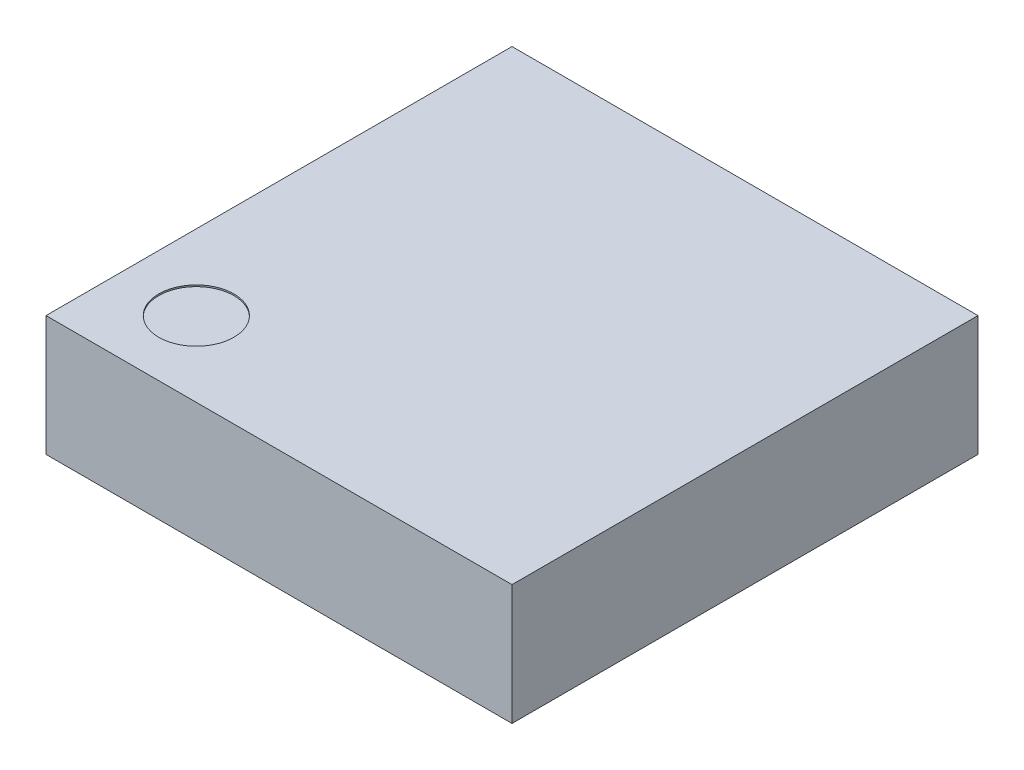
ISO-10303-21;
HEADER;
FILE_DESCRIPTION(('STEP AP214'),'2;1');
FILE_NAME('part.step','',(''),(''),'','','');
FILE_SCHEMA(('AUTOMOTIVE_DESIGN { 1 0 10303 214 1 1 1 1 }'));
ENDSEC;
DATA;
#1=APPLICATION_CONTEXT('core data for automotive mechanical design processes');
#2=APPLICATION_PROTOCOL_DEFINITION('international standard','automotive_design',2000,#1);
#3=PRODUCT_CONTEXT('',#1,'mechanical');
#4=PRODUCT('Part','Part','',(#3));
#5=PRODUCT_RELATED_PRODUCT_CATEGORY('part','',(#4));
#6=PRODUCT_DEFINITION_FORMATION('','',#4);
#7=PRODUCT_DEFINITION_CONTEXT('part definition',#1,'design');
#8=PRODUCT_DEFINITION('design','',#6,#7);
#9=PRODUCT_DEFINITION_SHAPE('','',#8);
#10=(LENGTH_UNIT() NAMED_UNIT(*) SI_UNIT(.MILLI.,.METRE.));
#11=(NAMED_UNIT(*) PLANE_ANGLE_UNIT() SI_UNIT($,.RADIAN.));
#12=(NAMED_UNIT(*) SI_UNIT($,.STERADIAN.) SOLID_ANGLE_UNIT());
#13=UNCERTAINTY_MEASURE_WITH_UNIT(LENGTH_MEASURE(1.E-05),#10,'distance_accuracy_value','');
#14=(GEOMETRIC_REPRESENTATION_CONTEXT(3) GLOBAL_UNCERTAINTY_ASSIGNED_CONTEXT((#13)) GLOBAL_UNIT_ASSIGNED_CONTEXT((#10,
#11,#12)) REPRESENTATION_CONTEXT('',''));
#15=CARTESIAN_POINT('',(0.,0.,0.));
#16=DIRECTION('',(0.,0.,1.));
#17=DIRECTION('',(1.,0.,0.));
#18=AXIS2_PLACEMENT_3D('',#15,#16,#17);
#19=CARTESIAN_POINT('',(1.55,0.8,1.55));
#20=DIRECTION('',(-1.,0.,0.));
#21=DIRECTION('',(0.,0.,1.));
#22=AXIS2_PLACEMENT_3D('',#19,#20,#21);
#23=PLANE('',#22);
#24=DIRECTION('',(0.,0.,-1.));
#25=VECTOR('',#24,1.);
#26=CARTESIAN_POINT('',(1.55,0.,1.55));
#27=LINE('',#26,#25);
#28=CARTESIAN_POINT('',(1.55,0.,1.55));
#29=VERTEX_POINT('',#28);
#30=CARTESIAN_POINT('',(1.55,0.,-1.55));
#31=VERTEX_POINT('',#30);
#32=EDGE_CURVE('E99',#29,#31,#27,.T.);
#33=ORIENTED_EDGE('',*,*,#32,.T.);
#34=DIRECTION('',(0.,-1.,0.));
#35=VECTOR('',#34,1.);
#36=CARTESIAN_POINT('',(1.55,0.8,-1.55));
#37=LINE('',#36,#35);
#38=CARTESIAN_POINT('',(1.55,0.8,-1.55));
#39=VERTEX_POINT('',#38);
#40=EDGE_CURVE('E11',#39,#31,#37,.T.);
#41=ORIENTED_EDGE('',*,*,#40,.F.);
#42=DIRECTION('',(0.,0.,-1.));
#43=VECTOR('',#42,1.);
#44=CARTESIAN_POINT('',(1.55,0.8,1.55));
#45=LINE('',#44,#43);
#46=CARTESIAN_POINT('',(1.55,0.8,1.55));
#47=VERTEX_POINT('',#46);
#48=EDGE_CURVE('E87',#47,#39,#45,.T.);
#49=ORIENTED_EDGE('',*,*,#48,.F.);
#50=DIRECTION('',(0.,-1.,0.));
#51=VECTOR('',#50,1.);
#52=CARTESIAN_POINT('',(1.55,0.8,1.55));
#53=LINE('',#52,#51);
#54=EDGE_CURVE('E95',#47,#29,#53,.T.);
#55=ORIENTED_EDGE('',*,*,#54,.T.);
#56=EDGE_LOOP('',(#33,#41,#49,#55));
#57=FACE_BOUND('',#56,.T.);
#58=ADVANCED_FACE('F36',(#57),#23,.F.);
#59=CARTESIAN_POINT('',(-1.55,0.8,-1.55));
#60=DIRECTION('',(0.,0.,1.));
#61=DIRECTION('',(1.,0.,0.));
#62=AXIS2_PLACEMENT_3D('',#59,#60,#61);
#63=PLANE('',#62);
#64=DIRECTION('',(-1.,0.,0.));
#65=VECTOR('',#64,1.);
#66=CARTESIAN_POINT('',(-1.55,0.,-1.55));
#67=LINE('',#66,#65);
#68=CARTESIAN_POINT('',(-1.55,0.,-1.55));
#69=VERTEX_POINT('',#68);
#70=EDGE_CURVE('E91',#31,#69,#67,.T.);
#71=ORIENTED_EDGE('',*,*,#70,.T.);
#72=DIRECTION('',(0.,-1.,0.));
#73=VECTOR('',#72,1.);
#74=CARTESIAN_POINT('',(-1.55,0.8,-1.55));
#75=LINE('',#74,#73);
#76=CARTESIAN_POINT('',(-1.55,0.8,-1.55));
#77=VERTEX_POINT('',#76);
#78=EDGE_CURVE('E44',#77,#69,#75,.T.);
#79=ORIENTED_EDGE('',*,*,#78,.F.);
#80=DIRECTION('',(-1.,0.,0.));
#81=VECTOR('',#80,1.);
#82=CARTESIAN_POINT('',(-1.55,0.8,-1.55));
#83=LINE('',#82,#81);
#84=EDGE_CURVE('E82',#39,#77,#83,.T.);
#85=ORIENTED_EDGE('',*,*,#84,.F.);
#86=ORIENTED_EDGE('',*,*,#40,.T.);
#87=EDGE_LOOP('',(#71,#79,#85,#86));
#88=FACE_BOUND('',#87,.T.);
#89=ADVANCED_FACE('F90',(#88),#63,.F.);
#90=CARTESIAN_POINT('',(-1.55,0.8,1.55));
#91=DIRECTION('',(1.,0.,0.));
#92=DIRECTION('',(0.,0.,-1.));
#93=AXIS2_PLACEMENT_3D('',#90,#91,#92);
#94=PLANE('',#93);
#95=DIRECTION('',(0.,0.,1.));
#96=VECTOR('',#95,1.);
#97=CARTESIAN_POINT('',(-1.55,0.,1.55));
#98=LINE('',#97,#96);
#99=CARTESIAN_POINT('',(-1.55,0.,1.55));
#100=VERTEX_POINT('',#99);
#101=EDGE_CURVE('E69',#69,#100,#98,.T.);
#102=ORIENTED_EDGE('',*,*,#101,.T.);
#103=DIRECTION('',(0.,-1.,0.));
#104=VECTOR('',#103,1.);
#105=CARTESIAN_POINT('',(-1.55,0.8,1.55));
#106=LINE('',#105,#104);
#107=CARTESIAN_POINT('',(-1.55,0.8,1.55));
#108=VERTEX_POINT('',#107);
#109=EDGE_CURVE('E92',#108,#100,#106,.T.);
#110=ORIENTED_EDGE('',*,*,#109,.F.);
#111=DIRECTION('',(0.,0.,1.));
#112=VECTOR('',#111,1.);
#113=CARTESIAN_POINT('',(-1.55,0.8,1.55));
#114=LINE('',#113,#112);
#115=EDGE_CURVE('E85',#77,#108,#114,.T.);
#116=ORIENTED_EDGE('',*,*,#115,.F.);
#117=ORIENTED_EDGE('',*,*,#78,.T.);
#118=EDGE_LOOP('',(#102,#110,#116,#117));
#119=FACE_BOUND('',#118,.T.);
#120=ADVANCED_FACE('F93',(#119),#94,.F.);
#121=CARTESIAN_POINT('',(-1.55,0.8,1.55));
#122=DIRECTION('',(0.,0.,-1.));
#123=DIRECTION('',(-1.,0.,0.));
#124=AXIS2_PLACEMENT_3D('',#121,#122,#123);
#125=PLANE('',#124);
#126=DIRECTION('',(1.,0.,0.));
#127=VECTOR('',#126,1.);
#128=CARTESIAN_POINT('',(-1.55,0.,1.55));
#129=LINE('',#128,#127);
#130=EDGE_CURVE('E75',#100,#29,#129,.T.);
#131=ORIENTED_EDGE('',*,*,#130,.T.);
#132=ORIENTED_EDGE('',*,*,#54,.F.);
#133=DIRECTION('',(1.,0.,0.));
#134=VECTOR('',#133,1.);
#135=CARTESIAN_POINT('',(-1.55,0.8,1.55));
#136=LINE('',#135,#134);
#137=EDGE_CURVE('E52',#108,#47,#136,.T.);
#138=ORIENTED_EDGE('',*,*,#137,.F.);
#139=ORIENTED_EDGE('',*,*,#109,.T.);
#140=EDGE_LOOP('',(#131,#132,#138,#139));
#141=FACE_BOUND('',#140,.T.);
#142=ADVANCED_FACE('F107',(#141),#125,.F.);
#143=CARTESIAN_POINT('',(0.,0.8,0.));
#144=DIRECTION('',(0.,-1.,0.));
#145=DIRECTION('',(0.,0.,-1.));
#146=AXIS2_PLACEMENT_3D('',#143,#144,#145);
#147=PLANE('',#146);
#148=CARTESIAN_POINT('',(-1.05,0.8,1.05));
#149=DIRECTION('',(0.,1.,0.));
#150=DIRECTION('',(0.,0.,1.));
#151=AXIS2_PLACEMENT_3D('',#148,#149,#150);
#152=CIRCLE('',#151,0.25);
#153=CARTESIAN_POINT('',(-1.05,0.8,1.3));
#154=VERTEX_POINT('',#153);
#155=EDGE_CURVE('E113',#154,#154,#152,.T.);
#156=ORIENTED_EDGE('',*,*,#155,.F.);
#157=EDGE_LOOP('',(#156));
#158=FACE_BOUND('',#157,.T.);
#159=ORIENTED_EDGE('',*,*,#48,.T.);
#160=ORIENTED_EDGE('',*,*,#84,.T.);
#161=ORIENTED_EDGE('',*,*,#115,.T.);
#162=ORIENTED_EDGE('',*,*,#137,.T.);
#163=EDGE_LOOP('',(#159,#160,#161,#162));
#164=FACE_BOUND('',#163,.T.);
#165=ADVANCED_FACE('F83',(#158,#164),#147,.F.);
#166=CARTESIAN_POINT('',(0.,0.,0.));
#167=DIRECTION('',(0.,-1.,0.));
#168=DIRECTION('',(0.,0.,-1.));
#169=AXIS2_PLACEMENT_3D('',#166,#167,#168);
#170=PLANE('',#169);
#171=ORIENTED_EDGE('',*,*,#32,.F.);
#172=ORIENTED_EDGE('',*,*,#130,.F.);
#173=ORIENTED_EDGE('',*,*,#101,.F.);
#174=ORIENTED_EDGE('',*,*,#70,.F.);
#175=EDGE_LOOP('',(#171,#172,#173,#174));
#176=FACE_BOUND('',#175,.T.);
#177=ADVANCED_FACE('F110',(#176),#170,.T.);
#178=CARTESIAN_POINT('',(-1.05,0.79,1.05));
#179=DIRECTION('',(0.,1.,0.));
#180=DIRECTION('',(0.,0.,1.));
#181=AXIS2_PLACEMENT_3D('',#178,#179,#180);
#182=CYLINDRICAL_SURFACE('',#181,0.25);
#183=CARTESIAN_POINT('',(-1.05,0.79,1.05));
#184=DIRECTION('',(0.,1.,0.));
#185=DIRECTION('',(0.,0.,1.));
#186=AXIS2_PLACEMENT_3D('',#183,#184,#185);
#187=CIRCLE('',#186,0.25);
#188=CARTESIAN_POINT('',(-1.05,0.79,1.3));
#189=VERTEX_POINT('',#188);
#190=EDGE_CURVE('E102',#189,#189,#187,.T.);
#191=ORIENTED_EDGE('',*,*,#190,.F.);
#192=EDGE_LOOP('',(#191));
#193=FACE_BOUND('',#192,.T.);
#194=ORIENTED_EDGE('',*,*,#155,.T.);
#195=EDGE_LOOP('',(#194));
#196=FACE_BOUND('',#195,.T.);
#197=ADVANCED_FACE('F121',(#193,#196),#182,.F.);
#198=CARTESIAN_POINT('',(-1.05,0.79,1.05));
#199=DIRECTION('',(0.,1.,0.));
#200=DIRECTION('',(0.,0.,1.));
#201=AXIS2_PLACEMENT_3D('',#198,#199,#200);
#202=PLANE('',#201);
#203=ORIENTED_EDGE('',*,*,#190,.T.);
#204=EDGE_LOOP('',(#203));
#205=FACE_BOUND('',#204,.T.);
#206=ADVANCED_FACE('F119',(#205),#202,.T.);
#207=CLOSED_SHELL('',(#58,#89,#120,#142,#165,#177,#197,#206));
#208=MANIFOLD_SOLID_BREP('B2',#207);
#209=ADVANCED_BREP_SHAPE_REPRESENTATION('',(#18,#208),#14);
#210=SHAPE_DEFINITION_REPRESENTATION(#9,#209);
ENDSEC;
END-ISO-10303-21;
